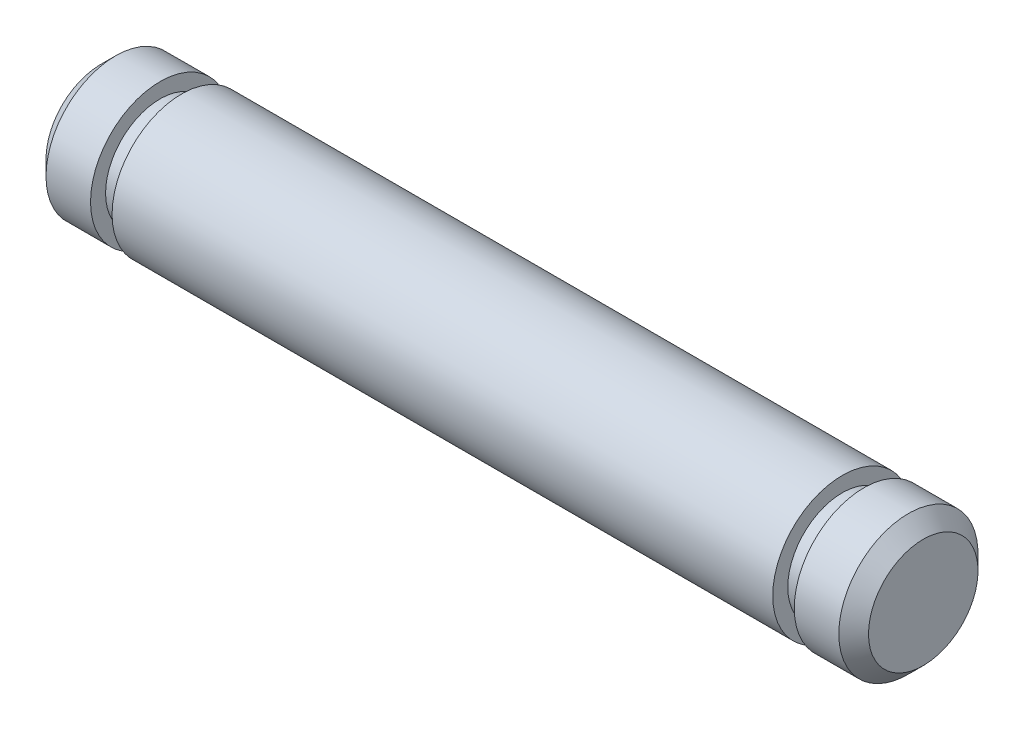
ISO-10303-21;
HEADER;
FILE_DESCRIPTION(('STEP AP214'),'2;1');
FILE_NAME('part.step','',(''),(''),'','','');
FILE_SCHEMA(('AUTOMOTIVE_DESIGN { 1 0 10303 214 1 1 1 1 }'));
ENDSEC;
DATA;
#1=APPLICATION_CONTEXT('core data for automotive mechanical design processes');
#2=APPLICATION_PROTOCOL_DEFINITION('international standard','automotive_design',2000,#1);
#3=PRODUCT_CONTEXT('',#1,'mechanical');
#4=PRODUCT('Part','Part','',(#3));
#5=PRODUCT_RELATED_PRODUCT_CATEGORY('part','',(#4));
#6=PRODUCT_DEFINITION_FORMATION('','',#4);
#7=PRODUCT_DEFINITION_CONTEXT('part definition',#1,'design');
#8=PRODUCT_DEFINITION('design','',#6,#7);
#9=PRODUCT_DEFINITION_SHAPE('','',#8);
#10=(LENGTH_UNIT() NAMED_UNIT(*) SI_UNIT(.MILLI.,.METRE.));
#11=(NAMED_UNIT(*) PLANE_ANGLE_UNIT() SI_UNIT($,.RADIAN.));
#12=(NAMED_UNIT(*) SI_UNIT($,.STERADIAN.) SOLID_ANGLE_UNIT());
#13=UNCERTAINTY_MEASURE_WITH_UNIT(LENGTH_MEASURE(1.E-05),#10,'distance_accuracy_value','');
#14=(GEOMETRIC_REPRESENTATION_CONTEXT(3) GLOBAL_UNCERTAINTY_ASSIGNED_CONTEXT((#13)) GLOBAL_UNIT_ASSIGNED_CONTEXT((#10,
#11,#12)) REPRESENTATION_CONTEXT('',''));
#15=CARTESIAN_POINT('',(0.,0.,0.));
#16=DIRECTION('',(0.,0.,1.));
#17=DIRECTION('',(1.,0.,0.));
#18=AXIS2_PLACEMENT_3D('',#15,#16,#17);
#19=CARTESIAN_POINT('',(-7.59460000000003,0.,0.));
#20=DIRECTION('',(1.,0.,0.));
#21=DIRECTION('',(0.,0.,-1.));
#22=AXIS2_PLACEMENT_3D('',#19,#20,#21);
#23=PLANE('',#22);
#24=CARTESIAN_POINT('',(-7.59460000000003,0.,0.));
#25=DIRECTION('',(1.,0.,0.));
#26=DIRECTION('',(0.,0.,-1.));
#27=AXIS2_PLACEMENT_3D('',#24,#25,#26);
#28=CIRCLE('',#27,1.87325);
#29=CARTESIAN_POINT('',(-7.59460000000003,0.,-1.87325));
#30=VERTEX_POINT('',#29);
#31=EDGE_CURVE('E60',#30,#30,#28,.F.);
#32=ORIENTED_EDGE('',*,*,#31,.T.);
#33=EDGE_LOOP('',(#32));
#34=FACE_BOUND('',#33,.T.);
#35=ADVANCED_FACE('F45',(#34),#23,.F.);
#36=CARTESIAN_POINT('',(20.5486,0.,0.));
#37=DIRECTION('',(-1.,0.,0.));
#38=DIRECTION('',(0.,0.,1.));
#39=AXIS2_PLACEMENT_3D('',#36,#37,#38);
#40=CYLINDRICAL_SURFACE('',#39,2.38125);
#41=CARTESIAN_POINT('',(-7.08660000000003,0.,0.));
#42=DIRECTION('',(1.,0.,0.));
#43=DIRECTION('',(0.,0.,-1.));
#44=AXIS2_PLACEMENT_3D('',#41,#42,#43);
#45=CIRCLE('',#44,2.38125);
#46=CARTESIAN_POINT('',(-7.08660000000003,0.,-2.38125));
#47=VERTEX_POINT('',#46);
#48=EDGE_CURVE('E56',#47,#47,#45,.T.);
#49=ORIENTED_EDGE('',*,*,#48,.T.);
#50=EDGE_LOOP('',(#49));
#51=FACE_BOUND('',#50,.T.);
#52=CARTESIAN_POINT('',(-5.56260000000003,0.,0.));
#53=DIRECTION('',(-1.,0.,0.));
#54=DIRECTION('',(0.,0.,1.));
#55=AXIS2_PLACEMENT_3D('',#52,#53,#54);
#56=CIRCLE('',#55,2.38125);
#57=CARTESIAN_POINT('',(-5.56260000000003,0.,2.38125));
#58=VERTEX_POINT('',#57);
#59=EDGE_CURVE('E65',#58,#58,#56,.T.);
#60=ORIENTED_EDGE('',*,*,#59,.T.);
#61=EDGE_LOOP('',(#60));
#62=FACE_BOUND('',#61,.T.);
#63=ADVANCED_FACE('F106',(#51,#62),#40,.T.);
#64=CARTESIAN_POINT('',(-5.56260000000003,2.38125,0.));
#65=DIRECTION('',(-1.,0.,0.));
#66=DIRECTION('',(0.,0.,1.));
#67=AXIS2_PLACEMENT_3D('',#64,#65,#66);
#68=PLANE('',#67);
#69=ORIENTED_EDGE('',*,*,#59,.F.);
#70=EDGE_LOOP('',(#69));
#71=FACE_BOUND('',#70,.T.);
#72=CARTESIAN_POINT('',(-5.56260000000003,0.,0.));
#73=DIRECTION('',(-1.,0.,0.));
#74=DIRECTION('',(0.,0.,1.));
#75=AXIS2_PLACEMENT_3D('',#72,#73,#74);
#76=CIRCLE('',#75,1.86690000000001);
#77=CARTESIAN_POINT('',(-5.56260000000003,0.,1.86690000000001));
#78=VERTEX_POINT('',#77);
#79=EDGE_CURVE('E68',#78,#78,#76,.T.);
#80=ORIENTED_EDGE('',*,*,#79,.T.);
#81=EDGE_LOOP('',(#80));
#82=FACE_BOUND('',#81,.T.);
#83=ADVANCED_FACE('F112',(#71,#82),#68,.F.);
#84=CARTESIAN_POINT('',(20.5486,0.,0.));
#85=DIRECTION('',(-1.,0.,0.));
#86=DIRECTION('',(0.,0.,1.));
#87=AXIS2_PLACEMENT_3D('',#84,#85,#86);
#88=CYLINDRICAL_SURFACE('',#87,1.86689999999999);
#89=ORIENTED_EDGE('',*,*,#79,.F.);
#90=EDGE_LOOP('',(#89));
#91=FACE_BOUND('',#90,.T.);
#92=CARTESIAN_POINT('',(-4.826,0.,0.));
#93=DIRECTION('',(-1.,0.,0.));
#94=DIRECTION('',(0.,0.,1.));
#95=AXIS2_PLACEMENT_3D('',#92,#93,#94);
#96=CIRCLE('',#95,1.86689999999997);
#97=CARTESIAN_POINT('',(-4.826,0.,1.86689999999997));
#98=VERTEX_POINT('',#97);
#99=EDGE_CURVE('E71',#98,#98,#96,.T.);
#100=ORIENTED_EDGE('',*,*,#99,.T.);
#101=EDGE_LOOP('',(#100));
#102=FACE_BOUND('',#101,.T.);
#103=ADVANCED_FACE('F130',(#91,#102),#88,.T.);
#104=CARTESIAN_POINT('',(-4.826,2.38125000000004,0.));
#105=DIRECTION('',(1.,0.,0.));
#106=DIRECTION('',(0.,0.,-1.));
#107=AXIS2_PLACEMENT_3D('',#104,#105,#106);
#108=PLANE('',#107);
#109=ORIENTED_EDGE('',*,*,#99,.F.);
#110=EDGE_LOOP('',(#109));
#111=FACE_BOUND('',#110,.T.);
#112=CARTESIAN_POINT('',(-4.826,0.,0.));
#113=DIRECTION('',(-1.,0.,0.));
#114=DIRECTION('',(0.,0.,1.));
#115=AXIS2_PLACEMENT_3D('',#112,#113,#114);
#116=CIRCLE('',#115,2.38125000000004);
#117=CARTESIAN_POINT('',(-4.826,0.,2.38125000000004));
#118=VERTEX_POINT('',#117);
#119=EDGE_CURVE('E74',#118,#118,#116,.T.);
#120=ORIENTED_EDGE('',*,*,#119,.T.);
#121=EDGE_LOOP('',(#120));
#122=FACE_BOUND('',#121,.T.);
#123=ADVANCED_FACE('F135',(#111,#122),#108,.F.);
#124=CARTESIAN_POINT('',(20.5486,0.,0.));
#125=DIRECTION('',(-1.,0.,0.));
#126=DIRECTION('',(0.,0.,1.));
#127=AXIS2_PLACEMENT_3D('',#124,#125,#126);
#128=CYLINDRICAL_SURFACE('',#127,2.38125000000002);
#129=ORIENTED_EDGE('',*,*,#119,.F.);
#130=EDGE_LOOP('',(#129));
#131=FACE_BOUND('',#130,.T.);
#132=CARTESIAN_POINT('',(17.78,0.,0.));
#133=DIRECTION('',(-1.,0.,0.));
#134=DIRECTION('',(0.,0.,1.));
#135=AXIS2_PLACEMENT_3D('',#132,#133,#134);
#136=CIRCLE('',#135,2.38125);
#137=CARTESIAN_POINT('',(17.78,0.,2.38125));
#138=VERTEX_POINT('',#137);
#139=EDGE_CURVE('E77',#138,#138,#136,.T.);
#140=ORIENTED_EDGE('',*,*,#139,.T.);
#141=EDGE_LOOP('',(#140));
#142=FACE_BOUND('',#141,.T.);
#143=ADVANCED_FACE('F141',(#131,#142),#128,.T.);
#144=CARTESIAN_POINT('',(17.78,2.38125,0.));
#145=DIRECTION('',(-1.,0.,0.));
#146=DIRECTION('',(0.,0.,1.));
#147=AXIS2_PLACEMENT_3D('',#144,#145,#146);
#148=PLANE('',#147);
#149=ORIENTED_EDGE('',*,*,#139,.F.);
#150=EDGE_LOOP('',(#149));
#151=FACE_BOUND('',#150,.T.);
#152=CARTESIAN_POINT('',(17.78,0.,0.));
#153=DIRECTION('',(-1.,0.,0.));
#154=DIRECTION('',(0.,0.,1.));
#155=AXIS2_PLACEMENT_3D('',#152,#153,#154);
#156=CIRCLE('',#155,1.86689999999998);
#157=CARTESIAN_POINT('',(17.78,0.,1.86689999999998));
#158=VERTEX_POINT('',#157);
#159=EDGE_CURVE('E80',#158,#158,#156,.T.);
#160=ORIENTED_EDGE('',*,*,#159,.T.);
#161=EDGE_LOOP('',(#160));
#162=FACE_BOUND('',#161,.T.);
#163=ADVANCED_FACE('F147',(#151,#162),#148,.F.);
#164=CARTESIAN_POINT('',(20.5486,0.,0.));
#165=DIRECTION('',(-1.,0.,0.));
#166=DIRECTION('',(0.,0.,1.));
#167=AXIS2_PLACEMENT_3D('',#164,#165,#166);
#168=CYLINDRICAL_SURFACE('',#167,1.86689999999998);
#169=ORIENTED_EDGE('',*,*,#159,.F.);
#170=EDGE_LOOP('',(#169));
#171=FACE_BOUND('',#170,.T.);
#172=CARTESIAN_POINT('',(18.5166,0.,0.));
#173=DIRECTION('',(-1.,0.,0.));
#174=DIRECTION('',(0.,0.,1.));
#175=AXIS2_PLACEMENT_3D('',#172,#173,#174);
#176=CIRCLE('',#175,1.86689999999998);
#177=CARTESIAN_POINT('',(18.5166,0.,1.86689999999998));
#178=VERTEX_POINT('',#177);
#179=EDGE_CURVE('E83',#178,#178,#176,.T.);
#180=ORIENTED_EDGE('',*,*,#179,.T.);
#181=EDGE_LOOP('',(#180));
#182=FACE_BOUND('',#181,.T.);
#183=ADVANCED_FACE('F102',(#171,#182),#168,.T.);
#184=CARTESIAN_POINT('',(18.5166,2.38125,0.));
#185=DIRECTION('',(1.,0.,0.));
#186=DIRECTION('',(0.,0.,-1.));
#187=AXIS2_PLACEMENT_3D('',#184,#185,#186);
#188=PLANE('',#187);
#189=ORIENTED_EDGE('',*,*,#179,.F.);
#190=EDGE_LOOP('',(#189));
#191=FACE_BOUND('',#190,.T.);
#192=CARTESIAN_POINT('',(18.5166,0.,0.));
#193=DIRECTION('',(-1.,0.,0.));
#194=DIRECTION('',(0.,0.,1.));
#195=AXIS2_PLACEMENT_3D('',#192,#193,#194);
#196=CIRCLE('',#195,2.38125);
#197=CARTESIAN_POINT('',(18.5166,0.,2.38125));
#198=VERTEX_POINT('',#197);
#199=EDGE_CURVE('E86',#198,#198,#196,.T.);
#200=ORIENTED_EDGE('',*,*,#199,.T.);
#201=EDGE_LOOP('',(#200));
#202=FACE_BOUND('',#201,.T.);
#203=ADVANCED_FACE('F90',(#191,#202),#188,.F.);
#204=CARTESIAN_POINT('',(20.5486,0.,0.));
#205=DIRECTION('',(-1.,0.,0.));
#206=DIRECTION('',(0.,0.,1.));
#207=AXIS2_PLACEMENT_3D('',#204,#205,#206);
#208=CYLINDRICAL_SURFACE('',#207,2.38125);
#209=CARTESIAN_POINT('',(20.0406,0.,0.));
#210=DIRECTION('',(-1.,0.,0.));
#211=DIRECTION('',(0.,0.,1.));
#212=AXIS2_PLACEMENT_3D('',#209,#210,#211);
#213=CIRCLE('',#212,2.38125);
#214=CARTESIAN_POINT('',(20.0406,0.,2.38125));
#215=VERTEX_POINT('',#214);
#216=EDGE_CURVE('E52',#215,#215,#213,.T.);
#217=ORIENTED_EDGE('',*,*,#216,.T.);
#218=EDGE_LOOP('',(#217));
#219=FACE_BOUND('',#218,.T.);
#220=ORIENTED_EDGE('',*,*,#199,.F.);
#221=EDGE_LOOP('',(#220));
#222=FACE_BOUND('',#221,.T.);
#223=ADVANCED_FACE('F92',(#219,#222),#208,.T.);
#224=CARTESIAN_POINT('',(20.5486,0.,0.));
#225=DIRECTION('',(-1.,0.,0.));
#226=DIRECTION('',(0.,0.,1.));
#227=AXIS2_PLACEMENT_3D('',#224,#225,#226);
#228=PLANE('',#227);
#229=CARTESIAN_POINT('',(20.5486,0.,0.));
#230=DIRECTION('',(-1.,0.,0.));
#231=DIRECTION('',(0.,0.,1.));
#232=AXIS2_PLACEMENT_3D('',#229,#230,#231);
#233=CIRCLE('',#232,1.87325);
#234=CARTESIAN_POINT('',(20.5486,0.,1.87325));
#235=VERTEX_POINT('',#234);
#236=EDGE_CURVE('E12',#235,#235,#233,.F.);
#237=ORIENTED_EDGE('',*,*,#236,.T.);
#238=EDGE_LOOP('',(#237));
#239=FACE_BOUND('',#238,.T.);
#240=ADVANCED_FACE('F94',(#239),#228,.F.);
#241=CARTESIAN_POINT('',(-7.59460000000003,0.,0.));
#242=DIRECTION('',(1.,0.,0.));
#243=DIRECTION('',(0.,0.,-1.));
#244=AXIS2_PLACEMENT_3D('',#241,#242,#243);
#245=CONICAL_SURFACE('',#244,1.87325,0.785398163397444);
#246=ORIENTED_EDGE('',*,*,#48,.F.);
#247=EDGE_LOOP('',(#246));
#248=FACE_BOUND('',#247,.T.);
#249=ORIENTED_EDGE('',*,*,#31,.F.);
#250=EDGE_LOOP('',(#249));
#251=FACE_BOUND('',#250,.T.);
#252=ADVANCED_FACE('F100',(#248,#251),#245,.T.);
#253=CARTESIAN_POINT('',(20.0406,0.,0.));
#254=DIRECTION('',(-1.,0.,0.));
#255=DIRECTION('',(0.,0.,1.));
#256=AXIS2_PLACEMENT_3D('',#253,#254,#255);
#257=CONICAL_SURFACE('',#256,2.38125,0.78539816339745);
#258=ORIENTED_EDGE('',*,*,#236,.F.);
#259=EDGE_LOOP('',(#258));
#260=FACE_BOUND('',#259,.T.);
#261=ORIENTED_EDGE('',*,*,#216,.F.);
#262=EDGE_LOOP('',(#261));
#263=FACE_BOUND('',#262,.T.);
#264=ADVANCED_FACE('F47',(#260,#263),#257,.T.);
#265=CLOSED_SHELL('',(#35,#63,#83,#103,#123,#143,#163,#183,#203,#223,#240,#252,#264));
#266=MANIFOLD_SOLID_BREP('B2',#265);
#267=ADVANCED_BREP_SHAPE_REPRESENTATION('',(#18,#266),#14);
#268=SHAPE_DEFINITION_REPRESENTATION(#9,#267);
ENDSEC;
END-ISO-10303-21;
